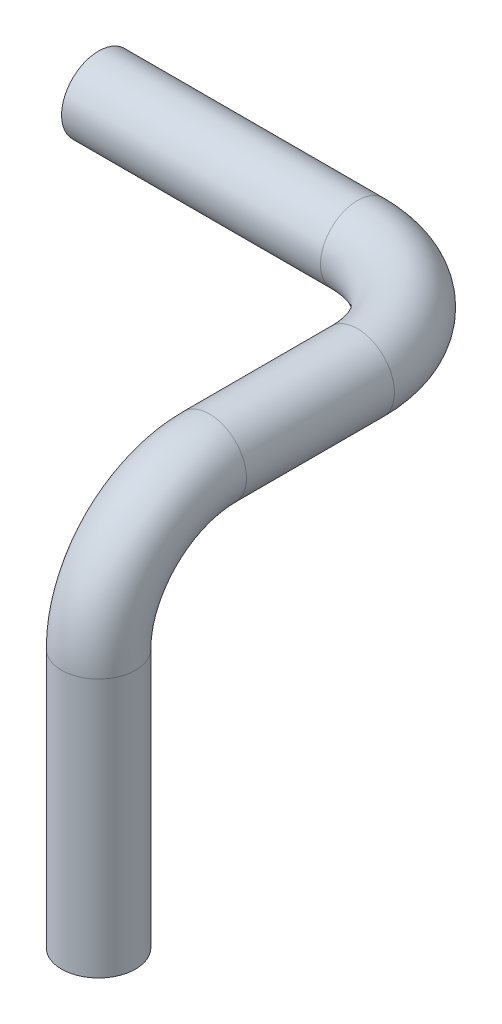
ISO-10303-21;
HEADER;
FILE_DESCRIPTION(('STEP AP214'),'2;1');
FILE_NAME('part.step','',(''),(''),'','','');
FILE_SCHEMA(('AUTOMOTIVE_DESIGN { 1 0 10303 214 1 1 1 1 }'));
ENDSEC;
DATA;
#1=APPLICATION_CONTEXT('core data for automotive mechanical design processes');
#2=APPLICATION_PROTOCOL_DEFINITION('international standard','automotive_design',2000,#1);
#3=PRODUCT_CONTEXT('',#1,'mechanical');
#4=PRODUCT('Part','Part','',(#3));
#5=PRODUCT_RELATED_PRODUCT_CATEGORY('part','',(#4));
#6=PRODUCT_DEFINITION_FORMATION('','',#4);
#7=PRODUCT_DEFINITION_CONTEXT('part definition',#1,'design');
#8=PRODUCT_DEFINITION('design','',#6,#7);
#9=PRODUCT_DEFINITION_SHAPE('','',#8);
#10=(LENGTH_UNIT() NAMED_UNIT(*) SI_UNIT(.MILLI.,.METRE.));
#11=(NAMED_UNIT(*) PLANE_ANGLE_UNIT() SI_UNIT($,.RADIAN.));
#12=(NAMED_UNIT(*) SI_UNIT($,.STERADIAN.) SOLID_ANGLE_UNIT());
#13=UNCERTAINTY_MEASURE_WITH_UNIT(LENGTH_MEASURE(1.E-05),#10,'distance_accuracy_value','');
#14=(GEOMETRIC_REPRESENTATION_CONTEXT(3) GLOBAL_UNCERTAINTY_ASSIGNED_CONTEXT((#13)) GLOBAL_UNIT_ASSIGNED_CONTEXT((#10,
#11,#12)) REPRESENTATION_CONTEXT('',''));
#15=CARTESIAN_POINT('',(0.,0.,0.));
#16=DIRECTION('',(0.,0.,1.));
#17=DIRECTION('',(1.,0.,0.));
#18=AXIS2_PLACEMENT_3D('',#15,#16,#17);
#19=CARTESIAN_POINT('',(0.,254.,0.));
#20=DIRECTION('',(-1.,0.,0.));
#21=DIRECTION('',(0.,1.,0.));
#22=AXIS2_PLACEMENT_3D('',#19,#20,#21);
#23=PLANE('',#22);
#24=CARTESIAN_POINT('',(0.,254.,0.));
#25=DIRECTION('',(-1.,0.,0.));
#26=DIRECTION('',(0.,0.,1.));
#27=AXIS2_PLACEMENT_3D('',#24,#25,#26);
#28=CIRCLE('',#27,22.86);
#29=CARTESIAN_POINT('',(0.,254.,22.86));
#30=VERTEX_POINT('',#29);
#31=EDGE_CURVE('E130',#30,#30,#28,.T.);
#32=ORIENTED_EDGE('',*,*,#31,.F.);
#33=EDGE_LOOP('',(#32));
#34=FACE_BOUND('',#33,.T.);
#35=CARTESIAN_POINT('',(0.,254.,0.));
#36=DIRECTION('',(-1.,0.,0.));
#37=DIRECTION('',(0.,1.,0.));
#38=AXIS2_PLACEMENT_3D('',#35,#36,#37);
#39=CIRCLE('',#38,25.4);
#40=CARTESIAN_POINT('',(0.,279.4,0.));
#41=VERTEX_POINT('',#40);
#42=EDGE_CURVE('E66',#41,#41,#39,.T.);
#43=ORIENTED_EDGE('',*,*,#42,.T.);
#44=EDGE_LOOP('',(#43));
#45=FACE_BOUND('',#44,.T.);
#46=ADVANCED_FACE('F53',(#34,#45),#23,.T.);
#47=CARTESIAN_POINT('',(254.,0.,254.));
#48=DIRECTION('',(0.,1.,0.));
#49=DIRECTION('',(0.,0.,1.));
#50=AXIS2_PLACEMENT_3D('',#47,#48,#49);
#51=PLANE('',#50);
#52=CARTESIAN_POINT('',(254.,0.,254.));
#53=DIRECTION('',(0.,1.,0.));
#54=DIRECTION('',(0.,0.,1.));
#55=AXIS2_PLACEMENT_3D('',#52,#53,#54);
#56=CIRCLE('',#55,22.86);
#57=CARTESIAN_POINT('',(254.,0.,276.86));
#58=VERTEX_POINT('',#57);
#59=EDGE_CURVE('E145',#58,#58,#56,.T.);
#60=ORIENTED_EDGE('',*,*,#59,.T.);
#61=EDGE_LOOP('',(#60));
#62=FACE_BOUND('',#61,.T.);
#63=CARTESIAN_POINT('',(254.,0.,254.));
#64=DIRECTION('',(0.,1.,0.));
#65=DIRECTION('',(0.,0.,1.));
#66=AXIS2_PLACEMENT_3D('',#63,#64,#65);
#67=CIRCLE('',#66,25.4);
#68=CARTESIAN_POINT('',(254.,0.,279.4));
#69=VERTEX_POINT('',#68);
#70=EDGE_CURVE('E12',#69,#69,#67,.T.);
#71=ORIENTED_EDGE('',*,*,#70,.F.);
#72=EDGE_LOOP('',(#71));
#73=FACE_BOUND('',#72,.T.);
#74=ADVANCED_FACE('F72',(#62,#73),#51,.F.);
#75=CARTESIAN_POINT('',(0.,254.,0.));
#76=DIRECTION('',(1.,0.,0.));
#77=DIRECTION('',(0.,0.,-1.));
#78=AXIS2_PLACEMENT_3D('',#75,#76,#77);
#79=CYLINDRICAL_SURFACE('',#78,25.4);
#80=CARTESIAN_POINT('',(177.8,254.,0.));
#81=DIRECTION('',(-1.,0.,0.));
#82=DIRECTION('',(0.,1.,0.));
#83=AXIS2_PLACEMENT_3D('',#80,#81,#82);
#84=CIRCLE('',#83,25.4);
#85=CARTESIAN_POINT('',(177.8,254.,-25.4));
#86=VERTEX_POINT('',#85);
#87=EDGE_CURVE('E151',#86,#86,#84,.T.);
#88=ORIENTED_EDGE('',*,*,#87,.T.);
#89=EDGE_LOOP('',(#88));
#90=FACE_BOUND('',#89,.T.);
#91=ORIENTED_EDGE('',*,*,#42,.F.);
#92=EDGE_LOOP('',(#91));
#93=FACE_BOUND('',#92,.T.);
#94=ADVANCED_FACE('F74',(#90,#93),#79,.T.);
#95=CARTESIAN_POINT('',(177.8,254.,76.2));
#96=DIRECTION('',(0.,-1.,0.));
#97=DIRECTION('',(0.,0.,-1.));
#98=AXIS2_PLACEMENT_3D('',#95,#96,#97);
#99=TOROIDAL_SURFACE('',#98,76.2,25.4);
#100=CARTESIAN_POINT('',(254.,254.,76.2));
#101=DIRECTION('',(0.,0.,-1.));
#102=DIRECTION('',(0.,1.,0.));
#103=AXIS2_PLACEMENT_3D('',#100,#101,#102);
#104=CIRCLE('',#103,25.4);
#105=CARTESIAN_POINT('',(279.4,254.,76.2));
#106=VERTEX_POINT('',#105);
#107=EDGE_CURVE('E155',#106,#106,#104,.T.);
#108=CARTESIAN_POINT('',(177.8,254.,76.2));
#109=DIRECTION('',(0.,-1.,0.));
#110=DIRECTION('',(0.,0.,-1.));
#111=AXIS2_PLACEMENT_3D('',#108,#109,#110);
#112=CIRCLE('',#111,101.6);
#113=EDGE_CURVE('',#86,#106,#112,.T.);
#114=ORIENTED_EDGE('',*,*,#87,.F.);
#115=ORIENTED_EDGE('',*,*,#107,.T.);
#116=ORIENTED_EDGE('',*,*,#113,.T.);
#117=ORIENTED_EDGE('',*,*,#113,.F.);
#118=EDGE_LOOP('',(#114,#116,#115,#117));
#119=FACE_BOUND('',#118,.T.);
#120=ADVANCED_FACE('F80',(#119),#99,.T.);
#121=CARTESIAN_POINT('',(254.,254.,76.2));
#122=DIRECTION('',(0.,0.,1.));
#123=DIRECTION('',(1.,0.,0.));
#124=AXIS2_PLACEMENT_3D('',#121,#122,#123);
#125=CYLINDRICAL_SURFACE('',#124,25.4);
#126=CARTESIAN_POINT('',(254.,254.,177.8));
#127=DIRECTION('',(0.,0.,-1.));
#128=DIRECTION('',(0.,1.,0.));
#129=AXIS2_PLACEMENT_3D('',#126,#127,#128);
#130=CIRCLE('',#129,25.4);
#131=CARTESIAN_POINT('',(254.,279.4,177.8));
#132=VERTEX_POINT('',#131);
#133=EDGE_CURVE('E159',#132,#132,#130,.T.);
#134=ORIENTED_EDGE('',*,*,#133,.T.);
#135=EDGE_LOOP('',(#134));
#136=FACE_BOUND('',#135,.T.);
#137=ORIENTED_EDGE('',*,*,#107,.F.);
#138=EDGE_LOOP('',(#137));
#139=FACE_BOUND('',#138,.T.);
#140=ADVANCED_FACE('F97',(#136,#139),#125,.T.);
#141=CARTESIAN_POINT('',(254.,177.8,177.8));
#142=DIRECTION('',(1.,0.,0.));
#143=DIRECTION('',(0.,0.,-1.));
#144=AXIS2_PLACEMENT_3D('',#141,#142,#143);
#145=TOROIDAL_SURFACE('',#144,76.2,25.4);
#146=CARTESIAN_POINT('',(254.,177.8,254.));
#147=DIRECTION('',(0.,1.,0.));
#148=DIRECTION('',(0.,0.,1.));
#149=AXIS2_PLACEMENT_3D('',#146,#147,#148);
#150=CIRCLE('',#149,25.4);
#151=CARTESIAN_POINT('',(254.,177.8,279.4));
#152=VERTEX_POINT('',#151);
#153=EDGE_CURVE('E61',#152,#152,#150,.T.);
#154=CARTESIAN_POINT('',(254.,177.8,177.8));
#155=DIRECTION('',(1.,0.,0.));
#156=DIRECTION('',(0.,0.,-1.));
#157=AXIS2_PLACEMENT_3D('',#154,#155,#156);
#158=CIRCLE('',#157,101.6);
#159=EDGE_CURVE('',#132,#152,#158,.T.);
#160=ORIENTED_EDGE('',*,*,#133,.F.);
#161=ORIENTED_EDGE('',*,*,#153,.T.);
#162=ORIENTED_EDGE('',*,*,#159,.T.);
#163=ORIENTED_EDGE('',*,*,#159,.F.);
#164=EDGE_LOOP('',(#160,#162,#161,#163));
#165=FACE_BOUND('',#164,.T.);
#166=ADVANCED_FACE('F89',(#165),#145,.T.);
#167=CARTESIAN_POINT('',(254.,177.8,254.));
#168=DIRECTION('',(0.,-1.,0.));
#169=DIRECTION('',(0.,0.,-1.));
#170=AXIS2_PLACEMENT_3D('',#167,#168,#169);
#171=CYLINDRICAL_SURFACE('',#170,25.4);
#172=ORIENTED_EDGE('',*,*,#70,.T.);
#173=EDGE_LOOP('',(#172));
#174=FACE_BOUND('',#173,.T.);
#175=ORIENTED_EDGE('',*,*,#153,.F.);
#176=EDGE_LOOP('',(#175));
#177=FACE_BOUND('',#176,.T.);
#178=ADVANCED_FACE('F69',(#174,#177),#171,.T.);
#179=CARTESIAN_POINT('',(0.,254.,0.));
#180=DIRECTION('',(1.,0.,0.));
#181=DIRECTION('',(0.,0.,-1.));
#182=AXIS2_PLACEMENT_3D('',#179,#180,#181);
#183=CYLINDRICAL_SURFACE('',#182,22.86);
#184=CARTESIAN_POINT('',(177.8,254.,0.));
#185=DIRECTION('',(1.,0.,0.));
#186=DIRECTION('',(0.,0.,-1.));
#187=AXIS2_PLACEMENT_3D('',#184,#185,#186);
#188=CIRCLE('',#187,22.86);
#189=CARTESIAN_POINT('',(177.8,254.,-22.86));
#190=VERTEX_POINT('',#189);
#191=EDGE_CURVE('E128',#190,#190,#188,.F.);
#192=ORIENTED_EDGE('',*,*,#191,.F.);
#193=EDGE_LOOP('',(#192));
#194=FACE_BOUND('',#193,.T.);
#195=ORIENTED_EDGE('',*,*,#31,.T.);
#196=EDGE_LOOP('',(#195));
#197=FACE_BOUND('',#196,.T.);
#198=ADVANCED_FACE('F88',(#194,#197),#183,.F.);
#199=CARTESIAN_POINT('',(177.8,254.,76.2));
#200=DIRECTION('',(0.,-1.,0.));
#201=DIRECTION('',(0.,0.,-1.));
#202=AXIS2_PLACEMENT_3D('',#199,#200,#201);
#203=TOROIDAL_SURFACE('',#202,76.2,22.86);
#204=CARTESIAN_POINT('',(254.,254.,76.2));
#205=DIRECTION('',(0.,0.,-1.));
#206=DIRECTION('',(-1.,0.,0.));
#207=AXIS2_PLACEMENT_3D('',#204,#205,#206);
#208=CIRCLE('',#207,22.86);
#209=CARTESIAN_POINT('',(276.86,254.,76.2));
#210=VERTEX_POINT('',#209);
#211=EDGE_CURVE('E125',#210,#210,#208,.T.);
#212=CARTESIAN_POINT('',(177.8,254.,76.2));
#213=DIRECTION('',(0.,-1.,0.));
#214=DIRECTION('',(0.,0.,-1.));
#215=AXIS2_PLACEMENT_3D('',#212,#213,#214);
#216=CIRCLE('',#215,99.06);
#217=EDGE_CURVE('',#190,#210,#216,.T.);
#218=ORIENTED_EDGE('',*,*,#191,.T.);
#219=ORIENTED_EDGE('',*,*,#211,.F.);
#220=ORIENTED_EDGE('',*,*,#217,.T.);
#221=ORIENTED_EDGE('',*,*,#217,.F.);
#222=EDGE_LOOP('',(#218,#220,#219,#221));
#223=FACE_BOUND('',#222,.T.);
#224=ADVANCED_FACE('F94',(#223),#203,.F.);
#225=CARTESIAN_POINT('',(254.,254.,76.2));
#226=DIRECTION('',(0.,0.,1.));
#227=DIRECTION('',(1.,0.,0.));
#228=AXIS2_PLACEMENT_3D('',#225,#226,#227);
#229=CYLINDRICAL_SURFACE('',#228,22.86);
#230=CARTESIAN_POINT('',(254.,254.,177.8));
#231=DIRECTION('',(0.,0.,1.));
#232=DIRECTION('',(1.,0.,0.));
#233=AXIS2_PLACEMENT_3D('',#230,#231,#232);
#234=CIRCLE('',#233,22.86);
#235=CARTESIAN_POINT('',(254.,276.86,177.8));
#236=VERTEX_POINT('',#235);
#237=EDGE_CURVE('E134',#236,#236,#234,.F.);
#238=ORIENTED_EDGE('',*,*,#237,.F.);
#239=EDGE_LOOP('',(#238));
#240=FACE_BOUND('',#239,.T.);
#241=ORIENTED_EDGE('',*,*,#211,.T.);
#242=EDGE_LOOP('',(#241));
#243=FACE_BOUND('',#242,.T.);
#244=ADVANCED_FACE('F113',(#240,#243),#229,.F.);
#245=CARTESIAN_POINT('',(254.,177.8,177.8));
#246=DIRECTION('',(1.,0.,0.));
#247=DIRECTION('',(0.,0.,-1.));
#248=AXIS2_PLACEMENT_3D('',#245,#246,#247);
#249=TOROIDAL_SURFACE('',#248,76.2,22.86);
#250=CARTESIAN_POINT('',(254.,177.8,254.));
#251=DIRECTION('',(0.,1.,0.));
#252=DIRECTION('',(0.,0.,1.));
#253=AXIS2_PLACEMENT_3D('',#250,#251,#252);
#254=CIRCLE('',#253,22.86);
#255=CARTESIAN_POINT('',(254.,177.8,276.86));
#256=VERTEX_POINT('',#255);
#257=EDGE_CURVE('E142',#256,#256,#254,.T.);
#258=CARTESIAN_POINT('',(254.,177.8,177.8));
#259=DIRECTION('',(1.,0.,0.));
#260=DIRECTION('',(0.,0.,-1.));
#261=AXIS2_PLACEMENT_3D('',#258,#259,#260);
#262=CIRCLE('',#261,99.06);
#263=EDGE_CURVE('',#236,#256,#262,.T.);
#264=ORIENTED_EDGE('',*,*,#237,.T.);
#265=ORIENTED_EDGE('',*,*,#257,.F.);
#266=ORIENTED_EDGE('',*,*,#263,.T.);
#267=ORIENTED_EDGE('',*,*,#263,.F.);
#268=EDGE_LOOP('',(#264,#266,#265,#267));
#269=FACE_BOUND('',#268,.T.);
#270=ADVANCED_FACE('F109',(#269),#249,.F.);
#271=CARTESIAN_POINT('',(254.,177.8,254.));
#272=DIRECTION('',(0.,-1.,0.));
#273=DIRECTION('',(0.,0.,-1.));
#274=AXIS2_PLACEMENT_3D('',#271,#272,#273);
#275=CYLINDRICAL_SURFACE('',#274,22.86);
#276=ORIENTED_EDGE('',*,*,#59,.F.);
#277=EDGE_LOOP('',(#276));
#278=FACE_BOUND('',#277,.T.);
#279=ORIENTED_EDGE('',*,*,#257,.T.);
#280=EDGE_LOOP('',(#279));
#281=FACE_BOUND('',#280,.T.);
#282=ADVANCED_FACE('F84',(#278,#281),#275,.F.);
#283=CLOSED_SHELL('',(#46,#74,#94,#120,#140,#166,#178,#198,#224,#244,#270,#282));
#284=MANIFOLD_SOLID_BREP('B2',#283);
#285=ADVANCED_BREP_SHAPE_REPRESENTATION('',(#18,#284),#14);
#286=SHAPE_DEFINITION_REPRESENTATION(#9,#285);
ENDSEC;
END-ISO-10303-21;
